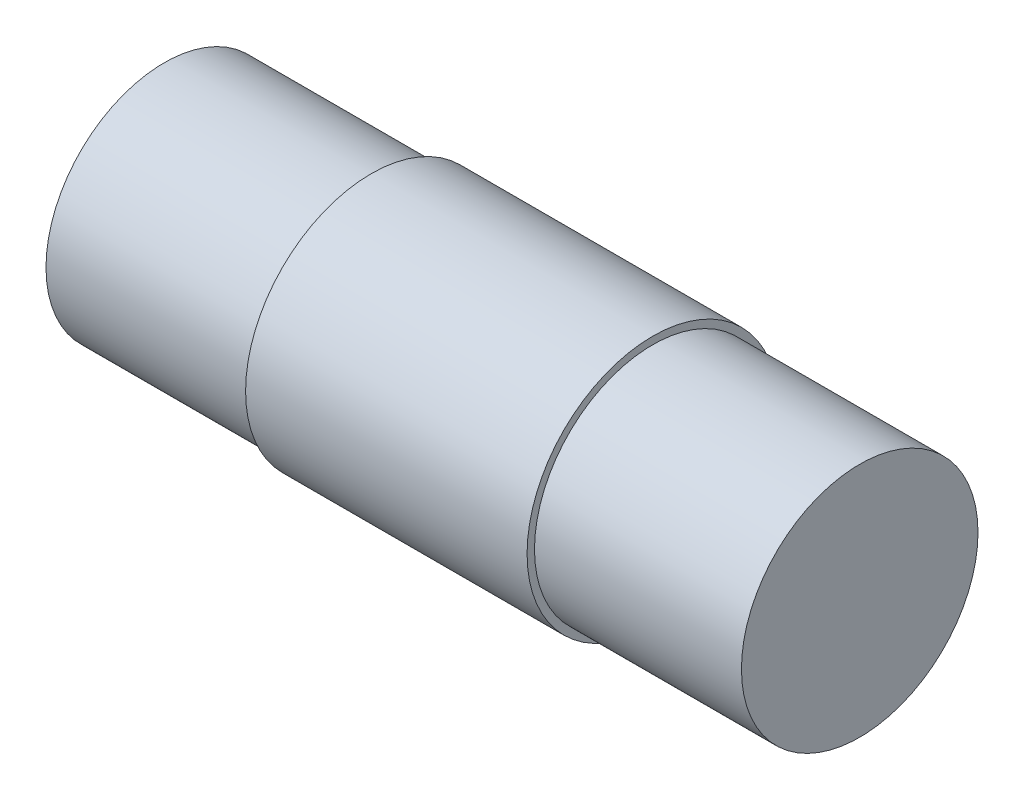
ISO-10303-21;
HEADER;
FILE_DESCRIPTION(('STEP AP214'),'2;1');
FILE_NAME('part.step','',(''),(''),'','','');
FILE_SCHEMA(('AUTOMOTIVE_DESIGN { 1 0 10303 214 1 1 1 1 }'));
ENDSEC;
DATA;
#1=APPLICATION_CONTEXT('core data for automotive mechanical design processes');
#2=APPLICATION_PROTOCOL_DEFINITION('international standard','automotive_design',2000,#1);
#3=PRODUCT_CONTEXT('',#1,'mechanical');
#4=PRODUCT('Part','Part','',(#3));
#5=PRODUCT_RELATED_PRODUCT_CATEGORY('part','',(#4));
#6=PRODUCT_DEFINITION_FORMATION('','',#4);
#7=PRODUCT_DEFINITION_CONTEXT('part definition',#1,'design');
#8=PRODUCT_DEFINITION('design','',#6,#7);
#9=PRODUCT_DEFINITION_SHAPE('','',#8);
#10=(LENGTH_UNIT() NAMED_UNIT(*) SI_UNIT(.MILLI.,.METRE.));
#11=(NAMED_UNIT(*) PLANE_ANGLE_UNIT() SI_UNIT($,.RADIAN.));
#12=(NAMED_UNIT(*) SI_UNIT($,.STERADIAN.) SOLID_ANGLE_UNIT());
#13=UNCERTAINTY_MEASURE_WITH_UNIT(LENGTH_MEASURE(1.E-05),#10,'distance_accuracy_value','');
#14=(GEOMETRIC_REPRESENTATION_CONTEXT(3) GLOBAL_UNCERTAINTY_ASSIGNED_CONTEXT((#13)) GLOBAL_UNIT_ASSIGNED_CONTEXT((#10,
#11,#12)) REPRESENTATION_CONTEXT('',''));
#15=CARTESIAN_POINT('',(0.,0.,0.));
#16=DIRECTION('',(0.,0.,1.));
#17=DIRECTION('',(1.,0.,0.));
#18=AXIS2_PLACEMENT_3D('',#15,#16,#17);
#19=CARTESIAN_POINT('',(-11.76,3.99999999999999,0.));
#20=DIRECTION('',(-1.,0.,0.));
#21=DIRECTION('',(0.,0.,1.));
#22=AXIS2_PLACEMENT_3D('',#19,#20,#21);
#23=PLANE('',#22);
#24=CARTESIAN_POINT('',(-11.76,0.,0.));
#25=DIRECTION('',(1.,0.,0.));
#26=DIRECTION('',(0.,0.,-1.));
#27=AXIS2_PLACEMENT_3D('',#24,#25,#26);
#28=CIRCLE('',#27,4.);
#29=CARTESIAN_POINT('',(-11.76,0.,-4.));
#30=VERTEX_POINT('',#29);
#31=EDGE_CURVE('E17',#30,#30,#28,.T.);
#32=ORIENTED_EDGE('',*,*,#31,.F.);
#33=EDGE_LOOP('',(#32));
#34=FACE_BOUND('',#33,.T.);
#35=ADVANCED_FACE('F14',(#34),#23,.T.);
#36=CARTESIAN_POINT('',(11.76,3.99999999999999,0.));
#37=DIRECTION('',(1.,0.,0.));
#38=DIRECTION('',(0.,0.,-1.));
#39=AXIS2_PLACEMENT_3D('',#36,#37,#38);
#40=PLANE('',#39);
#41=CARTESIAN_POINT('',(11.76,0.,0.));
#42=DIRECTION('',(1.,0.,0.));
#43=DIRECTION('',(0.,0.,-1.));
#44=AXIS2_PLACEMENT_3D('',#41,#42,#43);
#45=CIRCLE('',#44,4.);
#46=CARTESIAN_POINT('',(11.76,0.,-4.));
#47=VERTEX_POINT('',#46);
#48=EDGE_CURVE('E33',#47,#47,#45,.F.);
#49=ORIENTED_EDGE('',*,*,#48,.F.);
#50=EDGE_LOOP('',(#49));
#51=FACE_BOUND('',#50,.T.);
#52=ADVANCED_FACE('F44',(#51),#40,.T.);
#53=CARTESIAN_POINT('',(11.76,0.,0.));
#54=DIRECTION('',(1.,0.,0.));
#55=DIRECTION('',(0.,0.,-1.));
#56=AXIS2_PLACEMENT_3D('',#53,#54,#55);
#57=CYLINDRICAL_SURFACE('',#56,4.);
#58=ORIENTED_EDGE('',*,*,#31,.T.);
#59=EDGE_LOOP('',(#58));
#60=FACE_BOUND('',#59,.T.);
#61=CARTESIAN_POINT('',(-4.76,0.,0.));
#62=DIRECTION('',(1.,0.,0.));
#63=DIRECTION('',(0.,0.,-1.));
#64=AXIS2_PLACEMENT_3D('',#61,#62,#63);
#65=CIRCLE('',#64,4.);
#66=CARTESIAN_POINT('',(-4.76,0.,-4.));
#67=VERTEX_POINT('',#66);
#68=EDGE_CURVE('E31',#67,#67,#65,.T.);
#69=ORIENTED_EDGE('',*,*,#68,.F.);
#70=EDGE_LOOP('',(#69));
#71=FACE_BOUND('',#70,.T.);
#72=ADVANCED_FACE('F40',(#60,#71),#57,.T.);
#73=CARTESIAN_POINT('',(11.76,0.,0.));
#74=DIRECTION('',(1.,0.,0.));
#75=DIRECTION('',(0.,0.,-1.));
#76=AXIS2_PLACEMENT_3D('',#73,#74,#75);
#77=CYLINDRICAL_SURFACE('',#76,4.);
#78=CARTESIAN_POINT('',(4.76,0.,0.));
#79=DIRECTION('',(1.,0.,0.));
#80=DIRECTION('',(0.,0.,-1.));
#81=AXIS2_PLACEMENT_3D('',#78,#79,#80);
#82=CIRCLE('',#81,4.);
#83=CARTESIAN_POINT('',(4.76,0.,-4.));
#84=VERTEX_POINT('',#83);
#85=EDGE_CURVE('E26',#84,#84,#82,.F.);
#86=ORIENTED_EDGE('',*,*,#85,.F.);
#87=EDGE_LOOP('',(#86));
#88=FACE_BOUND('',#87,.T.);
#89=ORIENTED_EDGE('',*,*,#48,.T.);
#90=EDGE_LOOP('',(#89));
#91=FACE_BOUND('',#90,.T.);
#92=ADVANCED_FACE('F64',(#88,#91),#77,.T.);
#93=CARTESIAN_POINT('',(-4.76,4.24999999999999,0.));
#94=DIRECTION('',(-1.,0.,0.));
#95=DIRECTION('',(0.,0.,1.));
#96=AXIS2_PLACEMENT_3D('',#93,#94,#95);
#97=PLANE('',#96);
#98=CARTESIAN_POINT('',(-4.76,0.,0.));
#99=DIRECTION('',(1.,0.,0.));
#100=DIRECTION('',(0.,0.,-1.));
#101=AXIS2_PLACEMENT_3D('',#98,#99,#100);
#102=CIRCLE('',#101,4.25);
#103=CARTESIAN_POINT('',(-4.76,0.,-4.25));
#104=VERTEX_POINT('',#103);
#105=EDGE_CURVE('E21',#104,#104,#102,.T.);
#106=ORIENTED_EDGE('',*,*,#105,.F.);
#107=EDGE_LOOP('',(#106));
#108=FACE_BOUND('',#107,.T.);
#109=ORIENTED_EDGE('',*,*,#68,.T.);
#110=EDGE_LOOP('',(#109));
#111=FACE_BOUND('',#110,.T.);
#112=ADVANCED_FACE('F57',(#108,#111),#97,.T.);
#113=CARTESIAN_POINT('',(4.76,4.24999999999999,0.));
#114=DIRECTION('',(1.,0.,0.));
#115=DIRECTION('',(0.,0.,-1.));
#116=AXIS2_PLACEMENT_3D('',#113,#114,#115);
#117=PLANE('',#116);
#118=ORIENTED_EDGE('',*,*,#85,.T.);
#119=EDGE_LOOP('',(#118));
#120=FACE_BOUND('',#119,.T.);
#121=CARTESIAN_POINT('',(4.76,0.,0.));
#122=DIRECTION('',(1.,0.,0.));
#123=DIRECTION('',(0.,0.,-1.));
#124=AXIS2_PLACEMENT_3D('',#121,#122,#123);
#125=CIRCLE('',#124,4.25);
#126=CARTESIAN_POINT('',(4.76,0.,-4.25));
#127=VERTEX_POINT('',#126);
#128=EDGE_CURVE('E10',#127,#127,#125,.F.);
#129=ORIENTED_EDGE('',*,*,#128,.F.);
#130=EDGE_LOOP('',(#129));
#131=FACE_BOUND('',#130,.T.);
#132=ADVANCED_FACE('F52',(#120,#131),#117,.T.);
#133=CARTESIAN_POINT('',(11.76,0.,0.));
#134=DIRECTION('',(1.,0.,0.));
#135=DIRECTION('',(0.,0.,-1.));
#136=AXIS2_PLACEMENT_3D('',#133,#134,#135);
#137=CYLINDRICAL_SURFACE('',#136,4.25);
#138=ORIENTED_EDGE('',*,*,#128,.T.);
#139=EDGE_LOOP('',(#138));
#140=FACE_BOUND('',#139,.T.);
#141=ORIENTED_EDGE('',*,*,#105,.T.);
#142=EDGE_LOOP('',(#141));
#143=FACE_BOUND('',#142,.T.);
#144=ADVANCED_FACE('F50',(#140,#143),#137,.T.);
#145=CLOSED_SHELL('',(#35,#52,#72,#92,#112,#132,#144));
#146=MANIFOLD_SOLID_BREP('B1',#145);
#147=ADVANCED_BREP_SHAPE_REPRESENTATION('',(#18,#146),#14);
#148=SHAPE_DEFINITION_REPRESENTATION(#9,#147);
ENDSEC;
END-ISO-10303-21;
